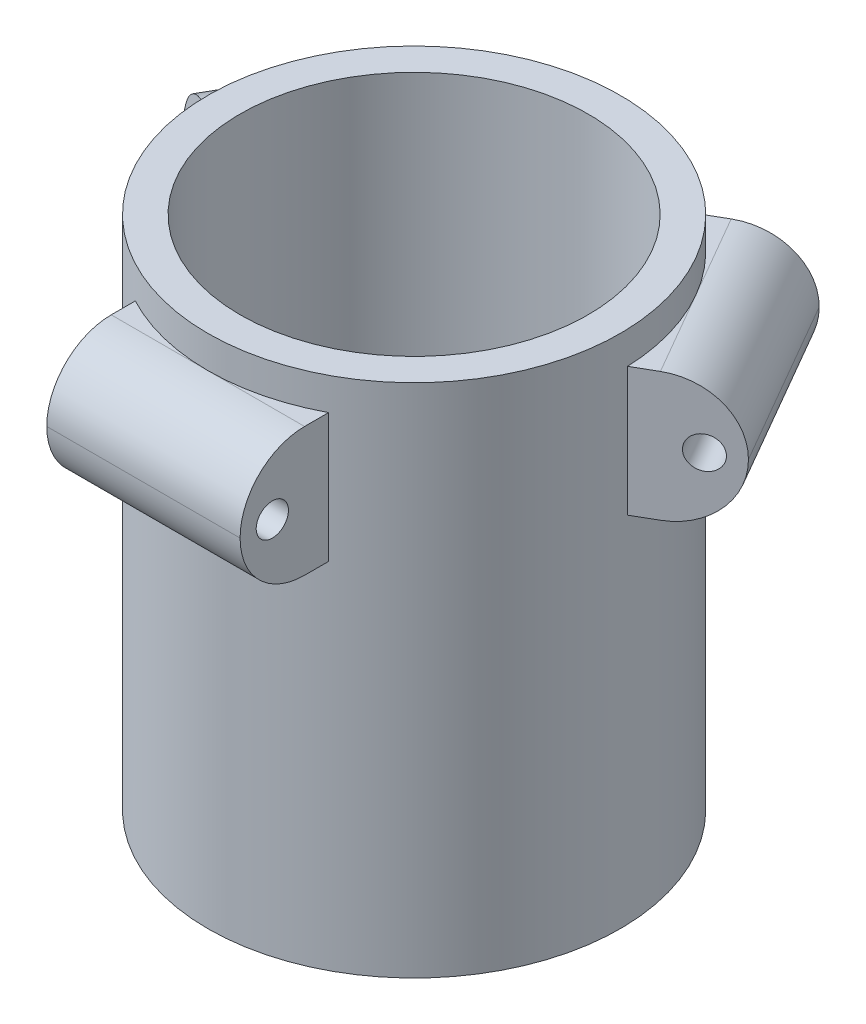
ISO-10303-21;
HEADER;
FILE_DESCRIPTION(('STEP AP214'),'2;1');
FILE_NAME('part.step','',(''),(''),'','','');
FILE_SCHEMA(('AUTOMOTIVE_DESIGN { 1 0 10303 214 1 1 1 1 }'));
ENDSEC;
DATA;
#1=APPLICATION_CONTEXT('core data for automotive mechanical design processes');
#2=APPLICATION_PROTOCOL_DEFINITION('international standard','automotive_design',2000,#1);
#3=PRODUCT_CONTEXT('',#1,'mechanical');
#4=PRODUCT('Part','Part','',(#3));
#5=PRODUCT_RELATED_PRODUCT_CATEGORY('part','',(#4));
#6=PRODUCT_DEFINITION_FORMATION('','',#4);
#7=PRODUCT_DEFINITION_CONTEXT('part definition',#1,'design');
#8=PRODUCT_DEFINITION('design','',#6,#7);
#9=PRODUCT_DEFINITION_SHAPE('','',#8);
#10=(LENGTH_UNIT() NAMED_UNIT(*) SI_UNIT(.MILLI.,.METRE.));
#11=(NAMED_UNIT(*) PLANE_ANGLE_UNIT() SI_UNIT($,.RADIAN.));
#12=(NAMED_UNIT(*) SI_UNIT($,.STERADIAN.) SOLID_ANGLE_UNIT());
#13=UNCERTAINTY_MEASURE_WITH_UNIT(LENGTH_MEASURE(1.E-05),#10,'distance_accuracy_value','');
#14=(GEOMETRIC_REPRESENTATION_CONTEXT(3) GLOBAL_UNCERTAINTY_ASSIGNED_CONTEXT((#13)) GLOBAL_UNIT_ASSIGNED_CONTEXT((#10,
#11,#12)) REPRESENTATION_CONTEXT('',''));
#15=CARTESIAN_POINT('',(0.,0.,0.));
#16=DIRECTION('',(0.,0.,1.));
#17=DIRECTION('',(1.,0.,0.));
#18=AXIS2_PLACEMENT_3D('',#15,#16,#17);
#19=CARTESIAN_POINT('',(0.,34.925,0.));
#20=DIRECTION('',(0.,-1.,0.));
#21=DIRECTION('',(0.866025403784443,0.,0.499999999999992));
#22=AXIS2_PLACEMENT_3D('',#19,#20,#21);
#23=PLANE('',#22);
#24=DIRECTION('',(-0.866025403784443,0.,-0.499999999999992));
#25=VECTOR('',#24,1.);
#26=CARTESIAN_POINT('',(-4.76249999999992,34.925,8.24889197104682));
#27=LINE('',#26,#25);
#28=CARTESIAN_POINT('',(-20.3070354144149,34.925,-0.725749734893167));
#29=VERTEX_POINT('',#28);
#30=CARTESIAN_POINT('',(-22.3601362048998,34.925,-1.91110802895301));
#31=VERTEX_POINT('',#30);
#32=EDGE_CURVE('E183',#29,#31,#27,.T.);
#33=ORIENTED_EDGE('',*,*,#32,.T.);
#34=DIRECTION('',(0.499999999999992,0.,-0.866025403784443));
#35=VECTOR('',#34,1.);
#36=CARTESIAN_POINT('',(-17.5976362048999,34.925,-10.1599999999998));
#37=LINE('',#36,#35);
#38=CARTESIAN_POINT('',(-17.5976362048999,34.925,-10.1599999999998));
#39=VERTEX_POINT('',#38);
#40=EDGE_CURVE('E11',#31,#39,#37,.T.);
#41=ORIENTED_EDGE('',*,*,#40,.T.);
#42=CARTESIAN_POINT('',(0.,34.925,0.));
#43=DIRECTION('',(0.,-1.,0.));
#44=DIRECTION('',(0.866025403784443,0.,0.499999999999992));
#45=AXIS2_PLACEMENT_3D('',#42,#43,#44);
#46=CIRCLE('',#45,20.32);
#47=EDGE_CURVE('E340',#29,#39,#46,.T.);
#48=ORIENTED_EDGE('',*,*,#47,.F.);
#49=EDGE_LOOP('',(#33,#41,#48));
#50=FACE_BOUND('',#49,.T.);
#51=ADVANCED_FACE('F37',(#50),#23,.T.);
#52=CARTESIAN_POINT('',(0.,47.625,0.));
#53=DIRECTION('',(0.,-1.,0.));
#54=DIRECTION('',(0.866025403784443,0.,0.499999999999992));
#55=AXIS2_PLACEMENT_3D('',#52,#53,#54);
#56=PLANE('',#55);
#57=DIRECTION('',(-0.866025403784443,0.,-0.499999999999992));
#58=VECTOR('',#57,1.);
#59=CARTESIAN_POINT('',(4.76249999999992,47.625,-8.24889197104681));
#60=LINE('',#59,#58);
#61=CARTESIAN_POINT('',(-10.7820354144151,47.625,-17.2235336769868));
#62=VERTEX_POINT('',#61);
#63=CARTESIAN_POINT('',(-12.8351362049,47.625,-18.4088919710467));
#64=VERTEX_POINT('',#63);
#65=EDGE_CURVE('E167',#62,#64,#60,.T.);
#66=ORIENTED_EDGE('',*,*,#65,.T.);
#67=DIRECTION('',(0.499999999999992,0.,-0.866025403784443));
#68=VECTOR('',#67,1.);
#69=CARTESIAN_POINT('',(-22.3601362048998,47.625,-1.91110802895302));
#70=LINE('',#69,#68);
#71=CARTESIAN_POINT('',(-17.5976362048999,47.625,-10.1599999999998));
#72=VERTEX_POINT('',#71);
#73=EDGE_CURVE('E169',#64,#72,#70,.F.);
#74=ORIENTED_EDGE('',*,*,#73,.T.);
#75=CARTESIAN_POINT('',(0.,47.625,0.));
#76=DIRECTION('',(0.,-1.,0.));
#77=DIRECTION('',(0.866025403784443,0.,0.499999999999992));
#78=AXIS2_PLACEMENT_3D('',#75,#76,#77);
#79=CIRCLE('',#78,20.32);
#80=EDGE_CURVE('E164',#72,#62,#79,.T.);
#81=ORIENTED_EDGE('',*,*,#80,.T.);
#82=EDGE_LOOP('',(#66,#74,#81));
#83=FACE_BOUND('',#82,.T.);
#84=ADVANCED_FACE('F166',(#83),#56,.F.);
#85=CARTESIAN_POINT('',(0.,34.925,0.));
#86=DIRECTION('',(0.,-1.,0.));
#87=DIRECTION('',(-0.866025403784436,0.,0.500000000000004));
#88=AXIS2_PLACEMENT_3D('',#85,#86,#87);
#89=PLANE('',#88);
#90=DIRECTION('',(0.866025403784436,0.,-0.500000000000004));
#91=VECTOR('',#90,1.);
#92=CARTESIAN_POINT('',(-4.76250000000004,34.925,-8.24889197104676));
#93=LINE('',#92,#91);
#94=CARTESIAN_POINT('',(10.7820354144149,34.925,-17.223533676987));
#95=VERTEX_POINT('',#94);
#96=CARTESIAN_POINT('',(12.8351362048997,34.925,-18.4088919710468));
#97=VERTEX_POINT('',#96);
#98=EDGE_CURVE('E202',#95,#97,#93,.T.);
#99=ORIENTED_EDGE('',*,*,#98,.T.);
#100=DIRECTION('',(0.500000000000004,0.,0.866025403784436));
#101=VECTOR('',#100,1.);
#102=CARTESIAN_POINT('',(17.5976362048998,34.925,-10.1600000000001));
#103=LINE('',#102,#101);
#104=CARTESIAN_POINT('',(17.5976362048998,34.925,-10.1600000000001));
#105=VERTEX_POINT('',#104);
#106=EDGE_CURVE('E308',#97,#105,#103,.T.);
#107=ORIENTED_EDGE('',*,*,#106,.T.);
#108=CARTESIAN_POINT('',(0.,34.925,0.));
#109=DIRECTION('',(0.,-1.,0.));
#110=DIRECTION('',(-0.866025403784436,0.,0.500000000000004));
#111=AXIS2_PLACEMENT_3D('',#108,#109,#110);
#112=CIRCLE('',#111,20.32);
#113=EDGE_CURVE('E213',#95,#105,#112,.T.);
#114=ORIENTED_EDGE('',*,*,#113,.F.);
#115=EDGE_LOOP('',(#99,#107,#114));
#116=FACE_BOUND('',#115,.T.);
#117=ADVANCED_FACE('F348',(#116),#89,.T.);
#118=CARTESIAN_POINT('',(0.,47.625,0.));
#119=DIRECTION('',(0.,-1.,0.));
#120=DIRECTION('',(-0.866025403784436,0.,0.500000000000004));
#121=AXIS2_PLACEMENT_3D('',#118,#119,#120);
#122=PLANE('',#121);
#123=DIRECTION('',(0.866025403784437,0.,-0.500000000000004));
#124=VECTOR('',#123,1.);
#125=CARTESIAN_POINT('',(4.76250000000003,47.625,8.24889197104675));
#126=LINE('',#125,#124);
#127=CARTESIAN_POINT('',(20.3070354144149,47.625,-0.725749734893456));
#128=VERTEX_POINT('',#127);
#129=CARTESIAN_POINT('',(22.3601362048998,47.625,-1.91110802895334));
#130=VERTEX_POINT('',#129);
#131=EDGE_CURVE('E198',#128,#130,#126,.T.);
#132=ORIENTED_EDGE('',*,*,#131,.T.);
#133=DIRECTION('',(0.500000000000004,0.,0.866025403784436));
#134=VECTOR('',#133,1.);
#135=CARTESIAN_POINT('',(12.8351362048997,47.625,-18.4088919710468));
#136=LINE('',#135,#134);
#137=CARTESIAN_POINT('',(17.5976362048998,47.625,-10.1600000000001));
#138=VERTEX_POINT('',#137);
#139=EDGE_CURVE('E299',#130,#138,#136,.F.);
#140=ORIENTED_EDGE('',*,*,#139,.T.);
#141=CARTESIAN_POINT('',(0.,47.625,0.));
#142=DIRECTION('',(0.,-1.,0.));
#143=DIRECTION('',(-0.866025403784436,0.,0.500000000000004));
#144=AXIS2_PLACEMENT_3D('',#141,#142,#143);
#145=CIRCLE('',#144,20.32);
#146=EDGE_CURVE('E201',#138,#128,#145,.T.);
#147=ORIENTED_EDGE('',*,*,#146,.T.);
#148=EDGE_LOOP('',(#132,#140,#147));
#149=FACE_BOUND('',#148,.T.);
#150=ADVANCED_FACE('F404',(#149),#122,.F.);
#151=CARTESIAN_POINT('',(0.,50.8,0.));
#152=DIRECTION('',(0.,-1.,0.));
#153=DIRECTION('',(0.,0.,-1.));
#154=AXIS2_PLACEMENT_3D('',#151,#152,#153);
#155=CYLINDRICAL_SURFACE('',#154,20.32);
#156=CARTESIAN_POINT('',(10.7820354144149,47.625,-17.223533676987));
#157=VERTEX_POINT('',#156);
#158=EDGE_CURVE('E203',#157,#138,#145,.T.);
#159=ORIENTED_EDGE('',*,*,#158,.F.);
#160=DIRECTION('',(0.,-1.,0.));
#161=VECTOR('',#160,1.);
#162=CARTESIAN_POINT('',(10.7820354144149,47.625,-17.223533676987));
#163=LINE('',#162,#161);
#164=EDGE_CURVE('E218',#157,#95,#163,.T.);
#165=ORIENTED_EDGE('',*,*,#164,.T.);
#166=ORIENTED_EDGE('',*,*,#113,.T.);
#167=CARTESIAN_POINT('',(20.3070354144149,34.925,-0.725749734893449));
#168=VERTEX_POINT('',#167);
#169=EDGE_CURVE('E212',#105,#168,#112,.T.);
#170=ORIENTED_EDGE('',*,*,#169,.T.);
#171=DIRECTION('',(0.,-1.,0.));
#172=VECTOR('',#171,1.);
#173=CARTESIAN_POINT('',(20.3070354144149,47.625,-0.725749734893456));
#174=LINE('',#173,#172);
#175=EDGE_CURVE('E209',#128,#168,#174,.T.);
#176=ORIENTED_EDGE('',*,*,#175,.F.);
#177=ORIENTED_EDGE('',*,*,#146,.F.);
#178=EDGE_LOOP('',(#159,#165,#166,#170,#176,#177));
#179=FACE_BOUND('',#178,.T.);
#180=CARTESIAN_POINT('',(0.,0.,0.));
#181=DIRECTION('',(0.,1.,0.));
#182=DIRECTION('',(0.,0.,1.));
#183=AXIS2_PLACEMENT_3D('',#180,#181,#182);
#184=CIRCLE('',#183,20.32);
#185=CARTESIAN_POINT('',(0.,0.,20.32));
#186=VERTEX_POINT('',#185);
#187=EDGE_CURVE('E266',#186,#186,#184,.T.);
#188=ORIENTED_EDGE('',*,*,#187,.T.);
#189=EDGE_LOOP('',(#188));
#190=FACE_BOUND('',#189,.T.);
#191=CARTESIAN_POINT('',(0.,50.8,0.));
#192=DIRECTION('',(0.,1.,0.));
#193=DIRECTION('',(0.,0.,1.));
#194=AXIS2_PLACEMENT_3D('',#191,#192,#193);
#195=CIRCLE('',#194,20.32);
#196=CARTESIAN_POINT('',(0.,50.8,20.32));
#197=VERTEX_POINT('',#196);
#198=EDGE_CURVE('E267',#197,#197,#195,.T.);
#199=ORIENTED_EDGE('',*,*,#198,.F.);
#200=EDGE_LOOP('',(#199));
#201=FACE_BOUND('',#200,.T.);
#202=CARTESIAN_POINT('',(0.,47.625,0.));
#203=DIRECTION('',(0.,-1.,0.));
#204=DIRECTION('',(0.,0.,-1.));
#205=AXIS2_PLACEMENT_3D('',#202,#203,#204);
#206=CIRCLE('',#205,20.32);
#207=CARTESIAN_POINT('',(9.525,47.625,17.9492834118803));
#208=VERTEX_POINT('',#207);
#209=CARTESIAN_POINT('',(0.,47.625,20.32));
#210=VERTEX_POINT('',#209);
#211=EDGE_CURVE('E236',#208,#210,#206,.T.);
#212=ORIENTED_EDGE('',*,*,#211,.F.);
#213=DIRECTION('',(0.,-1.,0.));
#214=VECTOR('',#213,1.);
#215=CARTESIAN_POINT('',(9.525,47.625,17.9492834118803));
#216=LINE('',#215,#214);
#217=CARTESIAN_POINT('',(9.525,34.925,17.9492834118803));
#218=VERTEX_POINT('',#217);
#219=EDGE_CURVE('E251',#208,#218,#216,.T.);
#220=ORIENTED_EDGE('',*,*,#219,.T.);
#221=CARTESIAN_POINT('',(0.,34.925,0.));
#222=DIRECTION('',(0.,-1.,0.));
#223=DIRECTION('',(0.,0.,-1.));
#224=AXIS2_PLACEMENT_3D('',#221,#222,#223);
#225=CIRCLE('',#224,20.32);
#226=CARTESIAN_POINT('',(0.,34.925,20.32));
#227=VERTEX_POINT('',#226);
#228=EDGE_CURVE('E246',#218,#227,#225,.T.);
#229=ORIENTED_EDGE('',*,*,#228,.T.);
#230=CARTESIAN_POINT('',(-9.525,34.925,17.9492834118803));
#231=VERTEX_POINT('',#230);
#232=EDGE_CURVE('E245',#227,#231,#225,.T.);
#233=ORIENTED_EDGE('',*,*,#232,.T.);
#234=DIRECTION('',(0.,-1.,0.));
#235=VECTOR('',#234,1.);
#236=CARTESIAN_POINT('',(-9.525,47.625,17.9492834118803));
#237=LINE('',#236,#235);
#238=CARTESIAN_POINT('',(-9.525,47.625,17.9492834118803));
#239=VERTEX_POINT('',#238);
#240=EDGE_CURVE('E242',#239,#231,#237,.T.);
#241=ORIENTED_EDGE('',*,*,#240,.F.);
#242=EDGE_CURVE('E234',#210,#239,#206,.T.);
#243=ORIENTED_EDGE('',*,*,#242,.F.);
#244=EDGE_LOOP('',(#212,#220,#229,#233,#241,#243));
#245=FACE_BOUND('',#244,.T.);
#246=CARTESIAN_POINT('',(-20.3070354144149,47.625,-0.725749734893167));
#247=VERTEX_POINT('',#246);
#248=EDGE_CURVE('E174',#247,#72,#79,.T.);
#249=ORIENTED_EDGE('',*,*,#248,.F.);
#250=DIRECTION('',(0.,-1.,0.));
#251=VECTOR('',#250,1.);
#252=CARTESIAN_POINT('',(-20.3070354144149,47.625,-0.725749734893167));
#253=LINE('',#252,#251);
#254=EDGE_CURVE('E189',#247,#29,#253,.T.);
#255=ORIENTED_EDGE('',*,*,#254,.T.);
#256=ORIENTED_EDGE('',*,*,#47,.T.);
#257=CARTESIAN_POINT('',(-10.7820354144151,34.925,-17.2235336769868));
#258=VERTEX_POINT('',#257);
#259=EDGE_CURVE('E187',#39,#258,#46,.T.);
#260=ORIENTED_EDGE('',*,*,#259,.T.);
#261=DIRECTION('',(0.,-1.,0.));
#262=VECTOR('',#261,1.);
#263=CARTESIAN_POINT('',(-10.7820354144151,47.625,-17.2235336769868));
#264=LINE('',#263,#262);
#265=EDGE_CURVE('E180',#62,#258,#264,.T.);
#266=ORIENTED_EDGE('',*,*,#265,.F.);
#267=ORIENTED_EDGE('',*,*,#80,.F.);
#268=EDGE_LOOP('',(#249,#255,#256,#260,#266,#267));
#269=FACE_BOUND('',#268,.T.);
#270=ADVANCED_FACE('F185',(#179,#190,#201,#245,#269),#155,.T.);
#271=CARTESIAN_POINT('',(0.,34.925,0.));
#272=DIRECTION('',(0.,-1.,0.));
#273=DIRECTION('',(0.,0.,-1.));
#274=AXIS2_PLACEMENT_3D('',#271,#272,#273);
#275=PLANE('',#274);
#276=DIRECTION('',(0.,0.,1.));
#277=VECTOR('',#276,1.);
#278=CARTESIAN_POINT('',(9.525,34.925,0.));
#279=LINE('',#278,#277);
#280=CARTESIAN_POINT('',(9.525,34.925,20.32));
#281=VERTEX_POINT('',#280);
#282=EDGE_CURVE('E235',#218,#281,#279,.T.);
#283=ORIENTED_EDGE('',*,*,#282,.T.);
#284=DIRECTION('',(-1.,0.,0.));
#285=VECTOR('',#284,1.);
#286=CARTESIAN_POINT('',(0.,34.925,20.32));
#287=LINE('',#286,#285);
#288=EDGE_CURVE('E289',#281,#227,#287,.T.);
#289=ORIENTED_EDGE('',*,*,#288,.T.);
#290=ORIENTED_EDGE('',*,*,#228,.F.);
#291=EDGE_LOOP('',(#283,#289,#290));
#292=FACE_BOUND('',#291,.T.);
#293=ADVANCED_FACE('F428',(#292),#275,.T.);
#294=CARTESIAN_POINT('',(0.,47.625,0.));
#295=DIRECTION('',(0.,-1.,0.));
#296=DIRECTION('',(0.,0.,-1.));
#297=AXIS2_PLACEMENT_3D('',#294,#295,#296);
#298=PLANE('',#297);
#299=DIRECTION('',(0.,0.,1.));
#300=VECTOR('',#299,1.);
#301=CARTESIAN_POINT('',(-9.52499999999999,47.625,0.));
#302=LINE('',#301,#300);
#303=CARTESIAN_POINT('',(-9.525,47.625,20.32));
#304=VERTEX_POINT('',#303);
#305=EDGE_CURVE('E231',#239,#304,#302,.T.);
#306=ORIENTED_EDGE('',*,*,#305,.T.);
#307=DIRECTION('',(-1.,0.,0.));
#308=VECTOR('',#307,1.);
#309=CARTESIAN_POINT('',(9.525,47.625,20.32));
#310=LINE('',#309,#308);
#311=EDGE_CURVE('E280',#304,#210,#310,.F.);
#312=ORIENTED_EDGE('',*,*,#311,.T.);
#313=ORIENTED_EDGE('',*,*,#242,.T.);
#314=EDGE_LOOP('',(#306,#312,#313));
#315=FACE_BOUND('',#314,.T.);
#316=ADVANCED_FACE('F424',(#315),#298,.F.);
#317=CARTESIAN_POINT('',(0.,50.8,0.));
#318=DIRECTION('',(0.,1.,0.));
#319=DIRECTION('',(0.,0.,1.));
#320=AXIS2_PLACEMENT_3D('',#317,#318,#319);
#321=PLANE('',#320);
#322=CARTESIAN_POINT('',(0.,50.8,0.));
#323=DIRECTION('',(0.,1.,0.));
#324=DIRECTION('',(0.,0.,1.));
#325=AXIS2_PLACEMENT_3D('',#322,#323,#324);
#326=CIRCLE('',#325,17.145);
#327=CARTESIAN_POINT('',(0.,50.8,17.145));
#328=VERTEX_POINT('',#327);
#329=EDGE_CURVE('E263',#328,#328,#326,.T.);
#330=ORIENTED_EDGE('',*,*,#329,.F.);
#331=EDGE_LOOP('',(#330));
#332=FACE_BOUND('',#331,.T.);
#333=ORIENTED_EDGE('',*,*,#198,.T.);
#334=EDGE_LOOP('',(#333));
#335=FACE_BOUND('',#334,.T.);
#336=ADVANCED_FACE('F449',(#332,#335),#321,.T.);
#337=CARTESIAN_POINT('',(0.,0.,0.));
#338=DIRECTION('',(0.,1.,0.));
#339=DIRECTION('',(0.,0.,1.));
#340=AXIS2_PLACEMENT_3D('',#337,#338,#339);
#341=PLANE('',#340);
#342=CARTESIAN_POINT('',(0.,0.,0.));
#343=DIRECTION('',(0.,1.,0.));
#344=DIRECTION('',(0.,0.,1.));
#345=AXIS2_PLACEMENT_3D('',#342,#343,#344);
#346=CIRCLE('',#345,4.064);
#347=CARTESIAN_POINT('',(0.,0.,4.064));
#348=VERTEX_POINT('',#347);
#349=EDGE_CURVE('E257',#348,#348,#346,.T.);
#350=ORIENTED_EDGE('',*,*,#349,.T.);
#351=EDGE_LOOP('',(#350));
#352=FACE_BOUND('',#351,.T.);
#353=ORIENTED_EDGE('',*,*,#187,.F.);
#354=EDGE_LOOP('',(#353));
#355=FACE_BOUND('',#354,.T.);
#356=ADVANCED_FACE('F444',(#352,#355),#341,.F.);
#357=CARTESIAN_POINT('',(0.,50.8,0.));
#358=DIRECTION('',(0.,-1.,0.));
#359=DIRECTION('',(0.,0.,-1.));
#360=AXIS2_PLACEMENT_3D('',#357,#358,#359);
#361=CYLINDRICAL_SURFACE('',#360,17.145);
#362=ORIENTED_EDGE('',*,*,#329,.T.);
#363=EDGE_LOOP('',(#362));
#364=FACE_BOUND('',#363,.T.);
#365=CARTESIAN_POINT('',(0.,3.175,0.));
#366=DIRECTION('',(0.,1.,0.));
#367=DIRECTION('',(0.,0.,1.));
#368=AXIS2_PLACEMENT_3D('',#365,#366,#367);
#369=CIRCLE('',#368,17.145);
#370=CARTESIAN_POINT('',(0.,3.175,17.145));
#371=VERTEX_POINT('',#370);
#372=EDGE_CURVE('E260',#371,#371,#369,.T.);
#373=ORIENTED_EDGE('',*,*,#372,.F.);
#374=EDGE_LOOP('',(#373));
#375=FACE_BOUND('',#374,.T.);
#376=ADVANCED_FACE('F441',(#364,#375),#361,.F.);
#377=CARTESIAN_POINT('',(0.,3.175,0.));
#378=DIRECTION('',(0.,1.,0.));
#379=DIRECTION('',(0.,0.,1.));
#380=AXIS2_PLACEMENT_3D('',#377,#378,#379);
#381=PLANE('',#380);
#382=CARTESIAN_POINT('',(0.,3.175,0.));
#383=DIRECTION('',(0.,1.,0.));
#384=DIRECTION('',(0.,0.,1.));
#385=AXIS2_PLACEMENT_3D('',#382,#383,#384);
#386=CIRCLE('',#385,4.064);
#387=CARTESIAN_POINT('',(0.,3.175,4.064));
#388=VERTEX_POINT('',#387);
#389=EDGE_CURVE('E254',#388,#388,#386,.T.);
#390=ORIENTED_EDGE('',*,*,#389,.F.);
#391=EDGE_LOOP('',(#390));
#392=FACE_BOUND('',#391,.T.);
#393=ORIENTED_EDGE('',*,*,#372,.T.);
#394=EDGE_LOOP('',(#393));
#395=FACE_BOUND('',#394,.T.);
#396=ADVANCED_FACE('F439',(#392,#395),#381,.T.);
#397=CARTESIAN_POINT('',(0.,-43.307,0.));
#398=DIRECTION('',(0.,1.,0.));
#399=DIRECTION('',(0.,0.,1.));
#400=AXIS2_PLACEMENT_3D('',#397,#398,#399);
#401=CYLINDRICAL_SURFACE('',#400,4.064);
#402=ORIENTED_EDGE('',*,*,#389,.T.);
#403=EDGE_LOOP('',(#402));
#404=FACE_BOUND('',#403,.T.);
#405=ORIENTED_EDGE('',*,*,#349,.F.);
#406=EDGE_LOOP('',(#405));
#407=FACE_BOUND('',#406,.T.);
#408=ADVANCED_FACE('F435',(#404,#407),#401,.F.);
#409=CARTESIAN_POINT('',(-9.52499999999999,47.625,0.));
#410=DIRECTION('',(1.,0.,0.));
#411=DIRECTION('',(0.,0.,-1.));
#412=AXIS2_PLACEMENT_3D('',#409,#410,#411);
#413=PLANE('',#412);
#414=CARTESIAN_POINT('',(-9.525,41.275,23.495));
#415=DIRECTION('',(1.,0.,0.));
#416=DIRECTION('',(0.,0.,-1.));
#417=AXIS2_PLACEMENT_3D('',#414,#415,#416);
#418=CIRCLE('',#417,1.5875);
#419=CARTESIAN_POINT('',(-9.525,41.275,21.9075));
#420=VERTEX_POINT('',#419);
#421=EDGE_CURVE('E227',#420,#420,#418,.F.);
#422=ORIENTED_EDGE('',*,*,#421,.F.);
#423=EDGE_LOOP('',(#422));
#424=FACE_BOUND('',#423,.T.);
#425=CARTESIAN_POINT('',(-9.525,41.275,20.32));
#426=DIRECTION('',(1.,0.,0.));
#427=DIRECTION('',(0.,0.,-1.));
#428=AXIS2_PLACEMENT_3D('',#425,#426,#427);
#429=CIRCLE('',#428,6.35);
#430=CARTESIAN_POINT('',(-9.525,34.925,20.32));
#431=VERTEX_POINT('',#430);
#432=CARTESIAN_POINT('',(-9.525,41.275,26.67));
#433=VERTEX_POINT('',#432);
#434=EDGE_CURVE('E270',#431,#433,#429,.F.);
#435=ORIENTED_EDGE('',*,*,#434,.T.);
#436=CARTESIAN_POINT('',(-9.525,41.275,20.32));
#437=DIRECTION('',(1.,0.,0.));
#438=DIRECTION('',(0.,0.,-1.));
#439=AXIS2_PLACEMENT_3D('',#436,#437,#438);
#440=CIRCLE('',#439,6.35);
#441=EDGE_CURVE('E276',#433,#304,#440,.F.);
#442=ORIENTED_EDGE('',*,*,#441,.T.);
#443=ORIENTED_EDGE('',*,*,#305,.F.);
#444=ORIENTED_EDGE('',*,*,#240,.T.);
#445=DIRECTION('',(0.,0.,1.));
#446=VECTOR('',#445,1.);
#447=CARTESIAN_POINT('',(-9.52499999999999,34.925,0.));
#448=LINE('',#447,#446);
#449=EDGE_CURVE('E230',#231,#431,#448,.T.);
#450=ORIENTED_EDGE('',*,*,#449,.T.);
#451=EDGE_LOOP('',(#435,#442,#443,#444,#450));
#452=FACE_BOUND('',#451,.T.);
#453=ADVANCED_FACE('F431',(#424,#452),#413,.F.);
#454=CARTESIAN_POINT('',(9.525,47.625,0.));
#455=DIRECTION('',(1.,0.,0.));
#456=DIRECTION('',(0.,0.,-1.));
#457=AXIS2_PLACEMENT_3D('',#454,#455,#456);
#458=PLANE('',#457);
#459=CARTESIAN_POINT('',(9.525,41.275,23.495));
#460=DIRECTION('',(1.,0.,0.));
#461=DIRECTION('',(0.,0.,-1.));
#462=AXIS2_PLACEMENT_3D('',#459,#460,#461);
#463=CIRCLE('',#462,1.5875);
#464=CARTESIAN_POINT('',(9.525,41.275,21.9075));
#465=VERTEX_POINT('',#464);
#466=EDGE_CURVE('E224',#465,#465,#463,.T.);
#467=ORIENTED_EDGE('',*,*,#466,.F.);
#468=EDGE_LOOP('',(#467));
#469=FACE_BOUND('',#468,.T.);
#470=DIRECTION('',(0.,0.,1.));
#471=VECTOR('',#470,1.);
#472=CARTESIAN_POINT('',(9.525,47.625,0.));
#473=LINE('',#472,#471);
#474=CARTESIAN_POINT('',(9.525,47.625,20.32));
#475=VERTEX_POINT('',#474);
#476=EDGE_CURVE('E239',#208,#475,#473,.T.);
#477=ORIENTED_EDGE('',*,*,#476,.T.);
#478=CARTESIAN_POINT('',(9.525,41.275,20.32));
#479=DIRECTION('',(1.,0.,0.));
#480=DIRECTION('',(0.,0.,-1.));
#481=AXIS2_PLACEMENT_3D('',#478,#479,#480);
#482=CIRCLE('',#481,6.35);
#483=CARTESIAN_POINT('',(9.525,41.275,26.67));
#484=VERTEX_POINT('',#483);
#485=EDGE_CURVE('E285',#475,#484,#482,.T.);
#486=ORIENTED_EDGE('',*,*,#485,.T.);
#487=CARTESIAN_POINT('',(9.525,41.275,20.32));
#488=DIRECTION('',(1.,0.,0.));
#489=DIRECTION('',(0.,0.,-1.));
#490=AXIS2_PLACEMENT_3D('',#487,#488,#489);
#491=CIRCLE('',#490,6.35);
#492=EDGE_CURVE('E283',#484,#281,#491,.T.);
#493=ORIENTED_EDGE('',*,*,#492,.T.);
#494=ORIENTED_EDGE('',*,*,#282,.F.);
#495=ORIENTED_EDGE('',*,*,#219,.F.);
#496=EDGE_LOOP('',(#477,#486,#493,#494,#495));
#497=FACE_BOUND('',#496,.T.);
#498=ADVANCED_FACE('F422',(#469,#497),#458,.T.);
#499=ORIENTED_EDGE('',*,*,#211,.T.);
#500=DIRECTION('',(-1.,0.,0.));
#501=VECTOR('',#500,1.);
#502=CARTESIAN_POINT('',(9.525,47.625,20.32));
#503=LINE('',#502,#501);
#504=EDGE_CURVE('E278',#210,#475,#503,.F.);
#505=ORIENTED_EDGE('',*,*,#504,.T.);
#506=ORIENTED_EDGE('',*,*,#476,.F.);
#507=EDGE_LOOP('',(#499,#505,#506));
#508=FACE_BOUND('',#507,.T.);
#509=ADVANCED_FACE('F419',(#508),#298,.F.);
#510=ORIENTED_EDGE('',*,*,#232,.F.);
#511=DIRECTION('',(-1.,0.,0.));
#512=VECTOR('',#511,1.);
#513=CARTESIAN_POINT('',(0.,34.925,20.32));
#514=LINE('',#513,#512);
#515=EDGE_CURVE('E287',#227,#431,#514,.T.);
#516=ORIENTED_EDGE('',*,*,#515,.T.);
#517=ORIENTED_EDGE('',*,*,#449,.F.);
#518=EDGE_LOOP('',(#510,#516,#517));
#519=FACE_BOUND('',#518,.T.);
#520=ADVANCED_FACE('F417',(#519),#275,.T.);
#521=CARTESIAN_POINT('',(-14.0151280605346,41.275,23.495));
#522=DIRECTION('',(1.,0.,0.));
#523=DIRECTION('',(0.,0.,-1.));
#524=AXIS2_PLACEMENT_3D('',#521,#522,#523);
#525=CYLINDRICAL_SURFACE('',#524,1.5875);
#526=ORIENTED_EDGE('',*,*,#421,.T.);
#527=EDGE_LOOP('',(#526));
#528=FACE_BOUND('',#527,.T.);
#529=ORIENTED_EDGE('',*,*,#466,.T.);
#530=EDGE_LOOP('',(#529));
#531=FACE_BOUND('',#530,.T.);
#532=ADVANCED_FACE('F413',(#528,#531),#525,.F.);
#533=CARTESIAN_POINT('',(0.,41.275,20.32));
#534=DIRECTION('',(-1.,0.,0.));
#535=DIRECTION('',(0.,0.,1.));
#536=AXIS2_PLACEMENT_3D('',#533,#534,#535);
#537=CYLINDRICAL_SURFACE('',#536,6.35);
#538=ORIENTED_EDGE('',*,*,#288,.F.);
#539=ORIENTED_EDGE('',*,*,#492,.F.);
#540=DIRECTION('',(-1.,0.,0.));
#541=VECTOR('',#540,1.);
#542=CARTESIAN_POINT('',(0.,41.275,26.67));
#543=LINE('',#542,#541);
#544=EDGE_CURVE('E221',#433,#484,#543,.F.);
#545=ORIENTED_EDGE('',*,*,#544,.F.);
#546=ORIENTED_EDGE('',*,*,#434,.F.);
#547=ORIENTED_EDGE('',*,*,#515,.F.);
#548=EDGE_LOOP('',(#538,#539,#545,#546,#547));
#549=FACE_BOUND('',#548,.T.);
#550=ADVANCED_FACE('F416',(#549),#537,.T.);
#551=CARTESIAN_POINT('',(0.,41.275,20.32));
#552=DIRECTION('',(1.,0.,0.));
#553=DIRECTION('',(0.,0.,-1.));
#554=AXIS2_PLACEMENT_3D('',#551,#552,#553);
#555=CYLINDRICAL_SURFACE('',#554,6.35);
#556=ORIENTED_EDGE('',*,*,#504,.F.);
#557=ORIENTED_EDGE('',*,*,#311,.F.);
#558=ORIENTED_EDGE('',*,*,#441,.F.);
#559=ORIENTED_EDGE('',*,*,#544,.T.);
#560=ORIENTED_EDGE('',*,*,#485,.F.);
#561=EDGE_LOOP('',(#556,#557,#558,#559,#560));
#562=FACE_BOUND('',#561,.T.);
#563=ADVANCED_FACE('F411',(#562),#555,.T.);
#564=CARTESIAN_POINT('',(4.76250000000003,47.625,8.24889197104675));
#565=DIRECTION('',(-0.500000000000004,0.,-0.866025403784436));
#566=DIRECTION('',(-0.866025403784437,0.,0.500000000000004));
#567=AXIS2_PLACEMENT_3D('',#564,#565,#566);
#568=PLANE('',#567);
#569=CARTESIAN_POINT('',(25.1097668619154,41.275,-3.49860802895334));
#570=DIRECTION('',(-0.500000000000004,0.,-0.866025403784437));
#571=DIRECTION('',(-0.866025403784436,0.,0.500000000000004));
#572=AXIS2_PLACEMENT_3D('',#569,#570,#571);
#573=CIRCLE('',#572,1.5875);
#574=CARTESIAN_POINT('',(23.7349515334076,41.275,-2.70485802895333));
#575=VERTEX_POINT('',#574);
#576=EDGE_CURVE('E330',#575,#575,#573,.F.);
#577=ORIENTED_EDGE('',*,*,#576,.F.);
#578=EDGE_LOOP('',(#577));
#579=FACE_BOUND('',#578,.T.);
#580=CARTESIAN_POINT('',(22.3601362048998,41.275,-1.91110802895333));
#581=DIRECTION('',(-0.500000000000004,0.,-0.866025403784436));
#582=DIRECTION('',(-0.866025403784437,0.,0.500000000000004));
#583=AXIS2_PLACEMENT_3D('',#580,#581,#582);
#584=CIRCLE('',#583,6.35);
#585=CARTESIAN_POINT('',(22.3601362048998,34.925,-1.91110802895334));
#586=VERTEX_POINT('',#585);
#587=CARTESIAN_POINT('',(27.859397518931,41.275,-5.08610802895336));
#588=VERTEX_POINT('',#587);
#589=EDGE_CURVE('E291',#586,#588,#584,.F.);
#590=ORIENTED_EDGE('',*,*,#589,.T.);
#591=CARTESIAN_POINT('',(22.3601362048998,41.275,-1.91110802895333));
#592=DIRECTION('',(-0.500000000000004,0.,-0.866025403784436));
#593=DIRECTION('',(-0.866025403784437,0.,0.500000000000004));
#594=AXIS2_PLACEMENT_3D('',#591,#592,#593);
#595=CIRCLE('',#594,6.35);
#596=EDGE_CURVE('E295',#588,#130,#595,.F.);
#597=ORIENTED_EDGE('',*,*,#596,.T.);
#598=ORIENTED_EDGE('',*,*,#131,.F.);
#599=ORIENTED_EDGE('',*,*,#175,.T.);
#600=DIRECTION('',(0.866025403784437,0.,-0.500000000000004));
#601=VECTOR('',#600,1.);
#602=CARTESIAN_POINT('',(4.76250000000003,34.925,8.24889197104675));
#603=LINE('',#602,#601);
#604=EDGE_CURVE('E193',#168,#586,#603,.T.);
#605=ORIENTED_EDGE('',*,*,#604,.T.);
#606=EDGE_LOOP('',(#590,#597,#598,#599,#605));
#607=FACE_BOUND('',#606,.T.);
#608=ADVANCED_FACE('F408',(#579,#607),#568,.F.);
#609=CARTESIAN_POINT('',(-4.76250000000004,47.625,-8.24889197104676));
#610=DIRECTION('',(-0.500000000000004,0.,-0.866025403784436));
#611=DIRECTION('',(-0.866025403784436,0.,0.500000000000004));
#612=AXIS2_PLACEMENT_3D('',#609,#610,#611);
#613=PLANE('',#612);
#614=CARTESIAN_POINT('',(15.5847668619153,41.275,-19.9963919710469));
#615=DIRECTION('',(-0.500000000000004,0.,-0.866025403784436));
#616=DIRECTION('',(-0.866025403784436,0.,0.500000000000004));
#617=AXIS2_PLACEMENT_3D('',#614,#615,#616);
#618=CIRCLE('',#617,1.5875);
#619=CARTESIAN_POINT('',(14.2099515334075,41.275,-19.2026419710469));
#620=VERTEX_POINT('',#619);
#621=EDGE_CURVE('E379',#620,#620,#618,.T.);
#622=ORIENTED_EDGE('',*,*,#621,.F.);
#623=EDGE_LOOP('',(#622));
#624=FACE_BOUND('',#623,.T.);
#625=DIRECTION('',(0.866025403784436,0.,-0.500000000000004));
#626=VECTOR('',#625,1.);
#627=CARTESIAN_POINT('',(-4.76250000000004,47.625,-8.24889197104676));
#628=LINE('',#627,#626);
#629=CARTESIAN_POINT('',(12.8351362048997,47.625,-18.4088919710468));
#630=VERTEX_POINT('',#629);
#631=EDGE_CURVE('E206',#157,#630,#628,.T.);
#632=ORIENTED_EDGE('',*,*,#631,.T.);
#633=CARTESIAN_POINT('',(12.8351362048997,41.275,-18.4088919710468));
#634=DIRECTION('',(-0.500000000000004,0.,-0.866025403784436));
#635=DIRECTION('',(-0.866025403784436,0.,0.500000000000004));
#636=AXIS2_PLACEMENT_3D('',#633,#634,#635);
#637=CIRCLE('',#636,6.35);
#638=CARTESIAN_POINT('',(18.3343975189309,41.275,-21.5838919710469));
#639=VERTEX_POINT('',#638);
#640=EDGE_CURVE('E304',#630,#639,#637,.T.);
#641=ORIENTED_EDGE('',*,*,#640,.T.);
#642=CARTESIAN_POINT('',(12.8351362048997,41.275,-18.4088919710468));
#643=DIRECTION('',(-0.500000000000004,0.,-0.866025403784436));
#644=DIRECTION('',(-0.866025403784436,0.,0.500000000000004));
#645=AXIS2_PLACEMENT_3D('',#642,#643,#644);
#646=CIRCLE('',#645,6.35);
#647=EDGE_CURVE('E302',#639,#97,#646,.T.);
#648=ORIENTED_EDGE('',*,*,#647,.T.);
#649=ORIENTED_EDGE('',*,*,#98,.F.);
#650=ORIENTED_EDGE('',*,*,#164,.F.);
#651=EDGE_LOOP('',(#632,#641,#648,#649,#650));
#652=FACE_BOUND('',#651,.T.);
#653=ADVANCED_FACE('F402',(#624,#652),#613,.T.);
#654=ORIENTED_EDGE('',*,*,#158,.T.);
#655=DIRECTION('',(0.500000000000004,0.,0.866025403784436));
#656=VECTOR('',#655,1.);
#657=CARTESIAN_POINT('',(12.8351362048997,47.625,-18.4088919710468));
#658=LINE('',#657,#656);
#659=EDGE_CURVE('E297',#138,#630,#658,.F.);
#660=ORIENTED_EDGE('',*,*,#659,.T.);
#661=ORIENTED_EDGE('',*,*,#631,.F.);
#662=EDGE_LOOP('',(#654,#660,#661));
#663=FACE_BOUND('',#662,.T.);
#664=ADVANCED_FACE('F397',(#663),#122,.F.);
#665=ORIENTED_EDGE('',*,*,#169,.F.);
#666=DIRECTION('',(0.500000000000004,0.,0.866025403784436));
#667=VECTOR('',#666,1.);
#668=CARTESIAN_POINT('',(17.5976362048998,34.925,-10.1600000000001));
#669=LINE('',#668,#667);
#670=EDGE_CURVE('E306',#105,#586,#669,.T.);
#671=ORIENTED_EDGE('',*,*,#670,.T.);
#672=ORIENTED_EDGE('',*,*,#604,.F.);
#673=EDGE_LOOP('',(#665,#671,#672));
#674=FACE_BOUND('',#673,.T.);
#675=ADVANCED_FACE('F392',(#674),#89,.T.);
#676=CARTESIAN_POINT('',(4.76249999999992,47.625,-8.24889197104681));
#677=DIRECTION('',(-0.499999999999992,0.,0.866025403784443));
#678=DIRECTION('',(0.866025403784443,0.,0.499999999999992));
#679=AXIS2_PLACEMENT_3D('',#676,#677,#678);
#680=PLANE('',#679);
#681=CARTESIAN_POINT('',(-15.5847668619156,41.275,-19.9963919710466));
#682=DIRECTION('',(-0.499999999999992,0.,0.866025403784443));
#683=DIRECTION('',(0.866025403784443,0.,0.499999999999992));
#684=AXIS2_PLACEMENT_3D('',#681,#682,#683);
#685=CIRCLE('',#684,1.5875);
#686=CARTESIAN_POINT('',(-14.2099515334078,41.275,-19.2026419710466));
#687=VERTEX_POINT('',#686);
#688=EDGE_CURVE('E381',#687,#687,#685,.F.);
#689=ORIENTED_EDGE('',*,*,#688,.F.);
#690=EDGE_LOOP('',(#689));
#691=FACE_BOUND('',#690,.T.);
#692=CARTESIAN_POINT('',(-12.8351362049,41.275,-18.4088919710467));
#693=DIRECTION('',(-0.499999999999992,0.,0.866025403784443));
#694=DIRECTION('',(0.866025403784443,0.,0.499999999999992));
#695=AXIS2_PLACEMENT_3D('',#692,#693,#694);
#696=CIRCLE('',#695,6.35);
#697=CARTESIAN_POINT('',(-12.8351362049,34.925,-18.4088919710467));
#698=VERTEX_POINT('',#697);
#699=CARTESIAN_POINT('',(-18.3343975189312,41.275,-21.5838919710466));
#700=VERTEX_POINT('',#699);
#701=EDGE_CURVE('E310',#698,#700,#696,.F.);
#702=ORIENTED_EDGE('',*,*,#701,.T.);
#703=CARTESIAN_POINT('',(-12.8351362049,41.275,-18.4088919710467));
#704=DIRECTION('',(-0.499999999999992,0.,0.866025403784443));
#705=DIRECTION('',(0.866025403784443,0.,0.499999999999992));
#706=AXIS2_PLACEMENT_3D('',#703,#704,#705);
#707=CIRCLE('',#706,6.35);
#708=EDGE_CURVE('E182',#700,#64,#707,.F.);
#709=ORIENTED_EDGE('',*,*,#708,.T.);
#710=ORIENTED_EDGE('',*,*,#65,.F.);
#711=ORIENTED_EDGE('',*,*,#265,.T.);
#712=DIRECTION('',(-0.866025403784443,0.,-0.499999999999992));
#713=VECTOR('',#712,1.);
#714=CARTESIAN_POINT('',(4.76249999999992,34.925,-8.24889197104681));
#715=LINE('',#714,#713);
#716=EDGE_CURVE('E326',#258,#698,#715,.T.);
#717=ORIENTED_EDGE('',*,*,#716,.T.);
#718=EDGE_LOOP('',(#702,#709,#710,#711,#717));
#719=FACE_BOUND('',#718,.T.);
#720=ADVANCED_FACE('F178',(#691,#719),#680,.F.);
#721=CARTESIAN_POINT('',(-4.76249999999992,47.625,8.24889197104682));
#722=DIRECTION('',(-0.499999999999992,0.,0.866025403784443));
#723=DIRECTION('',(0.866025403784443,0.,0.499999999999992));
#724=AXIS2_PLACEMENT_3D('',#721,#722,#723);
#725=PLANE('',#724);
#726=CARTESIAN_POINT('',(-25.1097668619154,41.275,-3.49860802895299));
#727=DIRECTION('',(-0.499999999999992,0.,0.866025403784443));
#728=DIRECTION('',(0.866025403784443,0.,0.499999999999992));
#729=AXIS2_PLACEMENT_3D('',#726,#727,#728);
#730=CIRCLE('',#729,1.5875);
#731=CARTESIAN_POINT('',(-23.7349515334076,41.275,-2.704858028953));
#732=VERTEX_POINT('',#731);
#733=EDGE_CURVE('E314',#732,#732,#730,.T.);
#734=ORIENTED_EDGE('',*,*,#733,.F.);
#735=EDGE_LOOP('',(#734));
#736=FACE_BOUND('',#735,.T.);
#737=DIRECTION('',(-0.866025403784443,0.,-0.499999999999992));
#738=VECTOR('',#737,1.);
#739=CARTESIAN_POINT('',(-4.76249999999992,47.625,8.24889197104682));
#740=LINE('',#739,#738);
#741=CARTESIAN_POINT('',(-22.3601362048998,47.625,-1.91110802895301));
#742=VERTEX_POINT('',#741);
#743=EDGE_CURVE('E190',#247,#742,#740,.T.);
#744=ORIENTED_EDGE('',*,*,#743,.T.);
#745=CARTESIAN_POINT('',(-22.3601362048998,41.275,-1.91110802895301));
#746=DIRECTION('',(-0.499999999999992,0.,0.866025403784443));
#747=DIRECTION('',(0.866025403784443,0.,0.499999999999992));
#748=AXIS2_PLACEMENT_3D('',#745,#746,#747);
#749=CIRCLE('',#748,6.35);
#750=CARTESIAN_POINT('',(-27.859397518931,41.275,-5.08610802895296));
#751=VERTEX_POINT('',#750);
#752=EDGE_CURVE('E59',#742,#751,#749,.T.);
#753=ORIENTED_EDGE('',*,*,#752,.T.);
#754=CARTESIAN_POINT('',(-22.3601362048998,41.275,-1.91110802895301));
#755=DIRECTION('',(-0.499999999999992,0.,0.866025403784443));
#756=DIRECTION('',(0.866025403784443,0.,0.499999999999992));
#757=AXIS2_PLACEMENT_3D('',#754,#755,#756);
#758=CIRCLE('',#757,6.35);
#759=EDGE_CURVE('E320',#751,#31,#758,.T.);
#760=ORIENTED_EDGE('',*,*,#759,.T.);
#761=ORIENTED_EDGE('',*,*,#32,.F.);
#762=ORIENTED_EDGE('',*,*,#254,.F.);
#763=EDGE_LOOP('',(#744,#753,#760,#761,#762));
#764=FACE_BOUND('',#763,.T.);
#765=ADVANCED_FACE('F338',(#736,#764),#725,.T.);
#766=ORIENTED_EDGE('',*,*,#248,.T.);
#767=DIRECTION('',(0.499999999999992,0.,-0.866025403784443));
#768=VECTOR('',#767,1.);
#769=CARTESIAN_POINT('',(-22.3601362048998,47.625,-1.91110802895302));
#770=LINE('',#769,#768);
#771=EDGE_CURVE('E317',#72,#742,#770,.F.);
#772=ORIENTED_EDGE('',*,*,#771,.T.);
#773=ORIENTED_EDGE('',*,*,#743,.F.);
#774=EDGE_LOOP('',(#766,#772,#773));
#775=FACE_BOUND('',#774,.T.);
#776=ADVANCED_FACE('F337',(#775),#56,.F.);
#777=ORIENTED_EDGE('',*,*,#259,.F.);
#778=DIRECTION('',(0.499999999999992,0.,-0.866025403784443));
#779=VECTOR('',#778,1.);
#780=CARTESIAN_POINT('',(-17.5976362048999,34.925,-10.1599999999998));
#781=LINE('',#780,#779);
#782=EDGE_CURVE('E46',#39,#698,#781,.T.);
#783=ORIENTED_EDGE('',*,*,#782,.T.);
#784=ORIENTED_EDGE('',*,*,#716,.F.);
#785=EDGE_LOOP('',(#777,#783,#784));
#786=FACE_BOUND('',#785,.T.);
#787=ADVANCED_FACE('F325',(#786),#23,.T.);
#788=CARTESIAN_POINT('',(-6.15740395459907,41.275,-36.3250635079094));
#789=DIRECTION('',(-0.499999999999992,0.,0.866025403784443));
#790=DIRECTION('',(0.866025403784443,0.,0.499999999999992));
#791=AXIS2_PLACEMENT_3D('',#788,#789,#790);
#792=CYLINDRICAL_SURFACE('',#791,1.5875);
#793=ORIENTED_EDGE('',*,*,#688,.T.);
#794=EDGE_LOOP('',(#793));
#795=FACE_BOUND('',#794,.T.);
#796=ORIENTED_EDGE('',*,*,#733,.T.);
#797=EDGE_LOOP('',(#796));
#798=FACE_BOUND('',#797,.T.);
#799=ADVANCED_FACE('F352',(#795,#798),#792,.F.);
#800=CARTESIAN_POINT('',(44.0621297692315,41.275,29.3278474500016));
#801=DIRECTION('',(-0.500000000000004,0.,-0.866025403784436));
#802=DIRECTION('',(-0.866025403784436,0.,0.500000000000004));
#803=AXIS2_PLACEMENT_3D('',#800,#801,#802);
#804=CYLINDRICAL_SURFACE('',#803,1.5875);
#805=ORIENTED_EDGE('',*,*,#576,.T.);
#806=EDGE_LOOP('',(#805));
#807=FACE_BOUND('',#806,.T.);
#808=ORIENTED_EDGE('',*,*,#621,.T.);
#809=EDGE_LOOP('',(#808));
#810=FACE_BOUND('',#809,.T.);
#811=ADVANCED_FACE('F357',(#807,#810),#804,.F.);
#812=CARTESIAN_POINT('',(17.5976362048998,41.275,-10.1600000000001));
#813=DIRECTION('',(0.500000000000004,0.,0.866025403784436));
#814=DIRECTION('',(0.866025403784436,0.,-0.500000000000004));
#815=AXIS2_PLACEMENT_3D('',#812,#813,#814);
#816=CYLINDRICAL_SURFACE('',#815,6.35);
#817=ORIENTED_EDGE('',*,*,#106,.F.);
#818=ORIENTED_EDGE('',*,*,#647,.F.);
#819=DIRECTION('',(0.500000000000004,0.,0.866025403784436));
#820=VECTOR('',#819,1.);
#821=CARTESIAN_POINT('',(23.0968975189309,41.275,-13.3350000000001));
#822=LINE('',#821,#820);
#823=EDGE_CURVE('E311',#588,#639,#822,.F.);
#824=ORIENTED_EDGE('',*,*,#823,.F.);
#825=ORIENTED_EDGE('',*,*,#589,.F.);
#826=ORIENTED_EDGE('',*,*,#670,.F.);
#827=EDGE_LOOP('',(#817,#818,#824,#825,#826));
#828=FACE_BOUND('',#827,.T.);
#829=ADVANCED_FACE('F366',(#828),#816,.T.);
#830=CARTESIAN_POINT('',(17.5976362048998,41.275,-10.1600000000001));
#831=DIRECTION('',(-0.500000000000004,0.,-0.866025403784436));
#832=DIRECTION('',(-0.866025403784436,0.,0.500000000000004));
#833=AXIS2_PLACEMENT_3D('',#830,#831,#832);
#834=CYLINDRICAL_SURFACE('',#833,6.35);
#835=ORIENTED_EDGE('',*,*,#659,.F.);
#836=ORIENTED_EDGE('',*,*,#139,.F.);
#837=ORIENTED_EDGE('',*,*,#596,.F.);
#838=ORIENTED_EDGE('',*,*,#823,.T.);
#839=ORIENTED_EDGE('',*,*,#640,.F.);
#840=EDGE_LOOP('',(#835,#836,#837,#838,#839));
#841=FACE_BOUND('',#840,.T.);
#842=ADVANCED_FACE('F371',(#841),#834,.T.);
#843=CARTESIAN_POINT('',(-17.5976362048999,41.275,-10.1599999999998));
#844=DIRECTION('',(0.499999999999992,0.,-0.866025403784443));
#845=DIRECTION('',(-0.866025403784443,0.,-0.499999999999992));
#846=AXIS2_PLACEMENT_3D('',#843,#844,#845);
#847=CYLINDRICAL_SURFACE('',#846,6.35);
#848=ORIENTED_EDGE('',*,*,#40,.F.);
#849=ORIENTED_EDGE('',*,*,#759,.F.);
#850=DIRECTION('',(0.499999999999992,0.,-0.866025403784443));
#851=VECTOR('',#850,1.);
#852=CARTESIAN_POINT('',(-23.0968975189311,41.275,-13.3349999999998));
#853=LINE('',#852,#851);
#854=EDGE_CURVE('E41',#700,#751,#853,.F.);
#855=ORIENTED_EDGE('',*,*,#854,.F.);
#856=ORIENTED_EDGE('',*,*,#701,.F.);
#857=ORIENTED_EDGE('',*,*,#782,.F.);
#858=EDGE_LOOP('',(#848,#849,#855,#856,#857));
#859=FACE_BOUND('',#858,.T.);
#860=ADVANCED_FACE('F39',(#859),#847,.T.);
#861=CARTESIAN_POINT('',(-17.5976362048999,41.275,-10.1599999999998));
#862=DIRECTION('',(-0.499999999999992,0.,0.866025403784443));
#863=DIRECTION('',(0.866025403784443,0.,0.499999999999992));
#864=AXIS2_PLACEMENT_3D('',#861,#862,#863);
#865=CYLINDRICAL_SURFACE('',#864,6.35);
#866=ORIENTED_EDGE('',*,*,#771,.F.);
#867=ORIENTED_EDGE('',*,*,#73,.F.);
#868=ORIENTED_EDGE('',*,*,#708,.F.);
#869=ORIENTED_EDGE('',*,*,#854,.T.);
#870=ORIENTED_EDGE('',*,*,#752,.F.);
#871=EDGE_LOOP('',(#866,#867,#868,#869,#870));
#872=FACE_BOUND('',#871,.T.);
#873=ADVANCED_FACE('F334',(#872),#865,.T.);
#874=CLOSED_SHELL('',(#51,#84,#117,#150,#270,#293,#316,#336,#356,#376,#396,#408,#453,#498,#509,
#520,#532,#550,#563,#608,#653,#664,#675,#720,#765,#776,#787,#799,#811,#829,#842,#860,#873));
#875=MANIFOLD_SOLID_BREP('B2',#874);
#876=ADVANCED_BREP_SHAPE_REPRESENTATION('',(#18,#875),#14);
#877=SHAPE_DEFINITION_REPRESENTATION(#9,#876);
ENDSEC;
END-ISO-10303-21;
